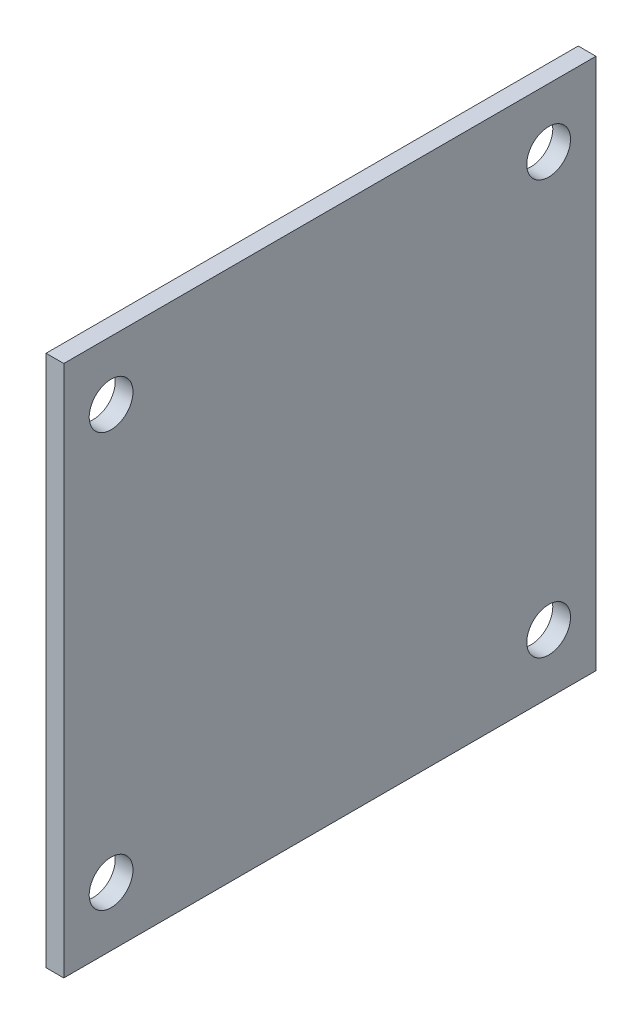
ISO-10303-21;
HEADER;
FILE_DESCRIPTION(('STEP AP214'),'2;1');
FILE_NAME('part.step','',(''),(''),'','','');
FILE_SCHEMA(('AUTOMOTIVE_DESIGN { 1 0 10303 214 1 1 1 1 }'));
ENDSEC;
DATA;
#1=APPLICATION_CONTEXT('core data for automotive mechanical design processes');
#2=APPLICATION_PROTOCOL_DEFINITION('international standard','automotive_design',2000,#1);
#3=PRODUCT_CONTEXT('',#1,'mechanical');
#4=PRODUCT('Part','Part','',(#3));
#5=PRODUCT_RELATED_PRODUCT_CATEGORY('part','',(#4));
#6=PRODUCT_DEFINITION_FORMATION('','',#4);
#7=PRODUCT_DEFINITION_CONTEXT('part definition',#1,'design');
#8=PRODUCT_DEFINITION('design','',#6,#7);
#9=PRODUCT_DEFINITION_SHAPE('','',#8);
#10=(LENGTH_UNIT() NAMED_UNIT(*) SI_UNIT(.MILLI.,.METRE.));
#11=(NAMED_UNIT(*) PLANE_ANGLE_UNIT() SI_UNIT($,.RADIAN.));
#12=(NAMED_UNIT(*) SI_UNIT($,.STERADIAN.) SOLID_ANGLE_UNIT());
#13=UNCERTAINTY_MEASURE_WITH_UNIT(LENGTH_MEASURE(1.E-05),#10,'distance_accuracy_value','');
#14=(GEOMETRIC_REPRESENTATION_CONTEXT(3) GLOBAL_UNCERTAINTY_ASSIGNED_CONTEXT((#13)) GLOBAL_UNIT_ASSIGNED_CONTEXT((#10,
#11,#12)) REPRESENTATION_CONTEXT('',''));
#15=CARTESIAN_POINT('',(0.,0.,0.));
#16=DIRECTION('',(0.,0.,1.));
#17=DIRECTION('',(1.,0.,0.));
#18=AXIS2_PLACEMENT_3D('',#15,#16,#17);
#19=CARTESIAN_POINT('',(1.5,-22.5,-22.5));
#20=DIRECTION('',(0.,0.,1.));
#21=DIRECTION('',(1.,0.,0.));
#22=AXIS2_PLACEMENT_3D('',#19,#20,#21);
#23=PLANE('',#22);
#24=DIRECTION('',(0.,1.,0.));
#25=VECTOR('',#24,1.);
#26=CARTESIAN_POINT('',(0.,-22.5,-22.5));
#27=LINE('',#26,#25);
#28=CARTESIAN_POINT('',(0.,-22.5,-22.5));
#29=VERTEX_POINT('',#28);
#30=CARTESIAN_POINT('',(0.,22.5,-22.5));
#31=VERTEX_POINT('',#30);
#32=EDGE_CURVE('E98',#29,#31,#27,.T.);
#33=ORIENTED_EDGE('',*,*,#32,.T.);
#34=DIRECTION('',(-1.,0.,0.));
#35=VECTOR('',#34,1.);
#36=CARTESIAN_POINT('',(1.5,22.5,-22.5));
#37=LINE('',#36,#35);
#38=CARTESIAN_POINT('',(1.5,22.5,-22.5));
#39=VERTEX_POINT('',#38);
#40=EDGE_CURVE('E11',#39,#31,#37,.T.);
#41=ORIENTED_EDGE('',*,*,#40,.F.);
#42=DIRECTION('',(0.,1.,0.));
#43=VECTOR('',#42,1.);
#44=CARTESIAN_POINT('',(1.5,-22.5,-22.5));
#45=LINE('',#44,#43);
#46=CARTESIAN_POINT('',(1.5,-22.5,-22.5));
#47=VERTEX_POINT('',#46);
#48=EDGE_CURVE('E86',#47,#39,#45,.T.);
#49=ORIENTED_EDGE('',*,*,#48,.F.);
#50=DIRECTION('',(-1.,0.,0.));
#51=VECTOR('',#50,1.);
#52=CARTESIAN_POINT('',(1.5,-22.5,-22.5));
#53=LINE('',#52,#51);
#54=EDGE_CURVE('E94',#47,#29,#53,.T.);
#55=ORIENTED_EDGE('',*,*,#54,.T.);
#56=EDGE_LOOP('',(#33,#41,#49,#55));
#57=FACE_BOUND('',#56,.T.);
#58=ADVANCED_FACE('F35',(#57),#23,.F.);
#59=CARTESIAN_POINT('',(1.5,22.5,22.5));
#60=DIRECTION('',(0.,-1.,0.));
#61=DIRECTION('',(0.,0.,-1.));
#62=AXIS2_PLACEMENT_3D('',#59,#60,#61);
#63=PLANE('',#62);
#64=DIRECTION('',(0.,0.,1.));
#65=VECTOR('',#64,1.);
#66=CARTESIAN_POINT('',(0.,22.5,22.5));
#67=LINE('',#66,#65);
#68=CARTESIAN_POINT('',(0.,22.5,22.5));
#69=VERTEX_POINT('',#68);
#70=EDGE_CURVE('E90',#31,#69,#67,.T.);
#71=ORIENTED_EDGE('',*,*,#70,.T.);
#72=DIRECTION('',(-1.,0.,0.));
#73=VECTOR('',#72,1.);
#74=CARTESIAN_POINT('',(1.5,22.5,22.5));
#75=LINE('',#74,#73);
#76=CARTESIAN_POINT('',(1.5,22.5,22.5));
#77=VERTEX_POINT('',#76);
#78=EDGE_CURVE('E43',#77,#69,#75,.T.);
#79=ORIENTED_EDGE('',*,*,#78,.F.);
#80=DIRECTION('',(0.,0.,1.));
#81=VECTOR('',#80,1.);
#82=CARTESIAN_POINT('',(1.5,22.5,22.5));
#83=LINE('',#82,#81);
#84=EDGE_CURVE('E81',#39,#77,#83,.T.);
#85=ORIENTED_EDGE('',*,*,#84,.F.);
#86=ORIENTED_EDGE('',*,*,#40,.T.);
#87=EDGE_LOOP('',(#71,#79,#85,#86));
#88=FACE_BOUND('',#87,.T.);
#89=ADVANCED_FACE('F89',(#88),#63,.F.);
#90=CARTESIAN_POINT('',(1.5,-22.5,22.5));
#91=DIRECTION('',(0.,0.,-1.));
#92=DIRECTION('',(-1.,0.,0.));
#93=AXIS2_PLACEMENT_3D('',#90,#91,#92);
#94=PLANE('',#93);
#95=DIRECTION('',(0.,-1.,0.));
#96=VECTOR('',#95,1.);
#97=CARTESIAN_POINT('',(0.,-22.5,22.5));
#98=LINE('',#97,#96);
#99=CARTESIAN_POINT('',(0.,-22.5,22.5));
#100=VERTEX_POINT('',#99);
#101=EDGE_CURVE('E68',#69,#100,#98,.T.);
#102=ORIENTED_EDGE('',*,*,#101,.T.);
#103=DIRECTION('',(-1.,0.,0.));
#104=VECTOR('',#103,1.);
#105=CARTESIAN_POINT('',(1.5,-22.5,22.5));
#106=LINE('',#105,#104);
#107=CARTESIAN_POINT('',(1.5,-22.5,22.5));
#108=VERTEX_POINT('',#107);
#109=EDGE_CURVE('E91',#108,#100,#106,.T.);
#110=ORIENTED_EDGE('',*,*,#109,.F.);
#111=DIRECTION('',(0.,-1.,0.));
#112=VECTOR('',#111,1.);
#113=CARTESIAN_POINT('',(1.5,-22.5,22.5));
#114=LINE('',#113,#112);
#115=EDGE_CURVE('E84',#77,#108,#114,.T.);
#116=ORIENTED_EDGE('',*,*,#115,.F.);
#117=ORIENTED_EDGE('',*,*,#78,.T.);
#118=EDGE_LOOP('',(#102,#110,#116,#117));
#119=FACE_BOUND('',#118,.T.);
#120=ADVANCED_FACE('F92',(#119),#94,.F.);
#121=CARTESIAN_POINT('',(1.5,-22.5,22.5));
#122=DIRECTION('',(0.,1.,0.));
#123=DIRECTION('',(0.,0.,1.));
#124=AXIS2_PLACEMENT_3D('',#121,#122,#123);
#125=PLANE('',#124);
#126=DIRECTION('',(0.,0.,-1.));
#127=VECTOR('',#126,1.);
#128=CARTESIAN_POINT('',(0.,-22.5,22.5));
#129=LINE('',#128,#127);
#130=EDGE_CURVE('E74',#100,#29,#129,.T.);
#131=ORIENTED_EDGE('',*,*,#130,.T.);
#132=ORIENTED_EDGE('',*,*,#54,.F.);
#133=DIRECTION('',(0.,0.,-1.));
#134=VECTOR('',#133,1.);
#135=CARTESIAN_POINT('',(1.5,-22.5,22.5));
#136=LINE('',#135,#134);
#137=EDGE_CURVE('E51',#108,#47,#136,.T.);
#138=ORIENTED_EDGE('',*,*,#137,.F.);
#139=ORIENTED_EDGE('',*,*,#109,.T.);
#140=EDGE_LOOP('',(#131,#132,#138,#139));
#141=FACE_BOUND('',#140,.T.);
#142=ADVANCED_FACE('F106',(#141),#125,.F.);
#143=CARTESIAN_POINT('',(1.5,22.5,-22.5));
#144=DIRECTION('',(-1.,0.,0.));
#145=DIRECTION('',(0.,0.,1.));
#146=AXIS2_PLACEMENT_3D('',#143,#144,#145);
#147=PLANE('',#146);
#148=CARTESIAN_POINT('',(1.5,-17.5,-18.5));
#149=DIRECTION('',(1.,0.,0.));
#150=DIRECTION('',(0.,0.,-1.));
#151=AXIS2_PLACEMENT_3D('',#148,#149,#150);
#152=CIRCLE('',#151,1.85);
#153=CARTESIAN_POINT('',(1.5,-17.5,-20.35));
#154=VERTEX_POINT('',#153);
#155=EDGE_CURVE('E130',#154,#154,#152,.T.);
#156=ORIENTED_EDGE('',*,*,#155,.F.);
#157=EDGE_LOOP('',(#156));
#158=FACE_BOUND('',#157,.T.);
#159=CARTESIAN_POINT('',(1.5,17.5,-18.5));
#160=DIRECTION('',(1.,0.,0.));
#161=DIRECTION('',(0.,0.,-1.));
#162=AXIS2_PLACEMENT_3D('',#159,#160,#161);
#163=CIRCLE('',#162,1.85);
#164=CARTESIAN_POINT('',(1.5,17.5,-20.35));
#165=VERTEX_POINT('',#164);
#166=EDGE_CURVE('E124',#165,#165,#163,.T.);
#167=ORIENTED_EDGE('',*,*,#166,.F.);
#168=EDGE_LOOP('',(#167));
#169=FACE_BOUND('',#168,.T.);
#170=CARTESIAN_POINT('',(1.5,-17.5,18.5));
#171=DIRECTION('',(1.,0.,0.));
#172=DIRECTION('',(0.,0.,-1.));
#173=AXIS2_PLACEMENT_3D('',#170,#171,#172);
#174=CIRCLE('',#173,1.85);
#175=CARTESIAN_POINT('',(1.5,-17.5,16.65));
#176=VERTEX_POINT('',#175);
#177=EDGE_CURVE('E118',#176,#176,#174,.T.);
#178=ORIENTED_EDGE('',*,*,#177,.F.);
#179=EDGE_LOOP('',(#178));
#180=FACE_BOUND('',#179,.T.);
#181=CARTESIAN_POINT('',(1.5,17.5,18.5));
#182=DIRECTION('',(1.,0.,0.));
#183=DIRECTION('',(0.,0.,-1.));
#184=AXIS2_PLACEMENT_3D('',#181,#182,#183);
#185=CIRCLE('',#184,1.85);
#186=CARTESIAN_POINT('',(1.5,17.5,16.65));
#187=VERTEX_POINT('',#186);
#188=EDGE_CURVE('E112',#187,#187,#185,.T.);
#189=ORIENTED_EDGE('',*,*,#188,.F.);
#190=EDGE_LOOP('',(#189));
#191=FACE_BOUND('',#190,.T.);
#192=ORIENTED_EDGE('',*,*,#48,.T.);
#193=ORIENTED_EDGE('',*,*,#84,.T.);
#194=ORIENTED_EDGE('',*,*,#115,.T.);
#195=ORIENTED_EDGE('',*,*,#137,.T.);
#196=EDGE_LOOP('',(#192,#193,#194,#195));
#197=FACE_BOUND('',#196,.T.);
#198=ADVANCED_FACE('F82',(#158,#169,#180,#191,#197),#147,.F.);
#199=CARTESIAN_POINT('',(0.,22.5,-22.5));
#200=DIRECTION('',(-1.,0.,0.));
#201=DIRECTION('',(0.,0.,1.));
#202=AXIS2_PLACEMENT_3D('',#199,#200,#201);
#203=PLANE('',#202);
#204=CARTESIAN_POINT('',(0.,-17.5,-18.5));
#205=DIRECTION('',(1.,0.,0.));
#206=DIRECTION('',(0.,0.,-1.));
#207=AXIS2_PLACEMENT_3D('',#204,#205,#206);
#208=CIRCLE('',#207,1.85);
#209=CARTESIAN_POINT('',(0.,-17.5,-20.35));
#210=VERTEX_POINT('',#209);
#211=EDGE_CURVE('E127',#210,#210,#208,.T.);
#212=ORIENTED_EDGE('',*,*,#211,.T.);
#213=EDGE_LOOP('',(#212));
#214=FACE_BOUND('',#213,.T.);
#215=CARTESIAN_POINT('',(0.,17.5,-18.5));
#216=DIRECTION('',(1.,0.,0.));
#217=DIRECTION('',(0.,0.,-1.));
#218=AXIS2_PLACEMENT_3D('',#215,#216,#217);
#219=CIRCLE('',#218,1.85);
#220=CARTESIAN_POINT('',(0.,17.5,-20.35));
#221=VERTEX_POINT('',#220);
#222=EDGE_CURVE('E121',#221,#221,#219,.T.);
#223=ORIENTED_EDGE('',*,*,#222,.T.);
#224=EDGE_LOOP('',(#223));
#225=FACE_BOUND('',#224,.T.);
#226=CARTESIAN_POINT('',(0.,-17.5,18.5));
#227=DIRECTION('',(1.,0.,0.));
#228=DIRECTION('',(0.,0.,-1.));
#229=AXIS2_PLACEMENT_3D('',#226,#227,#228);
#230=CIRCLE('',#229,1.85);
#231=CARTESIAN_POINT('',(0.,-17.5,16.65));
#232=VERTEX_POINT('',#231);
#233=EDGE_CURVE('E115',#232,#232,#230,.T.);
#234=ORIENTED_EDGE('',*,*,#233,.T.);
#235=EDGE_LOOP('',(#234));
#236=FACE_BOUND('',#235,.T.);
#237=CARTESIAN_POINT('',(0.,17.5,18.5));
#238=DIRECTION('',(1.,0.,0.));
#239=DIRECTION('',(0.,0.,-1.));
#240=AXIS2_PLACEMENT_3D('',#237,#238,#239);
#241=CIRCLE('',#240,1.85);
#242=CARTESIAN_POINT('',(0.,17.5,16.65));
#243=VERTEX_POINT('',#242);
#244=EDGE_CURVE('E101',#243,#243,#241,.T.);
#245=ORIENTED_EDGE('',*,*,#244,.T.);
#246=EDGE_LOOP('',(#245));
#247=FACE_BOUND('',#246,.T.);
#248=ORIENTED_EDGE('',*,*,#32,.F.);
#249=ORIENTED_EDGE('',*,*,#130,.F.);
#250=ORIENTED_EDGE('',*,*,#101,.F.);
#251=ORIENTED_EDGE('',*,*,#70,.F.);
#252=EDGE_LOOP('',(#248,#249,#250,#251));
#253=FACE_BOUND('',#252,.T.);
#254=ADVANCED_FACE('F109',(#214,#225,#236,#247,#253),#203,.T.);
#255=CARTESIAN_POINT('',(0.,17.5,18.5));
#256=DIRECTION('',(1.,0.,0.));
#257=DIRECTION('',(0.,0.,-1.));
#258=AXIS2_PLACEMENT_3D('',#255,#256,#257);
#259=CYLINDRICAL_SURFACE('',#258,1.85);
#260=ORIENTED_EDGE('',*,*,#244,.F.);
#261=EDGE_LOOP('',(#260));
#262=FACE_BOUND('',#261,.T.);
#263=ORIENTED_EDGE('',*,*,#188,.T.);
#264=EDGE_LOOP('',(#263));
#265=FACE_BOUND('',#264,.T.);
#266=ADVANCED_FACE('F154',(#262,#265),#259,.F.);
#267=CARTESIAN_POINT('',(0.,-17.5,18.5));
#268=DIRECTION('',(1.,0.,0.));
#269=DIRECTION('',(0.,0.,-1.));
#270=AXIS2_PLACEMENT_3D('',#267,#268,#269);
#271=CYLINDRICAL_SURFACE('',#270,1.85);
#272=ORIENTED_EDGE('',*,*,#233,.F.);
#273=EDGE_LOOP('',(#272));
#274=FACE_BOUND('',#273,.T.);
#275=ORIENTED_EDGE('',*,*,#177,.T.);
#276=EDGE_LOOP('',(#275));
#277=FACE_BOUND('',#276,.T.);
#278=ADVANCED_FACE('F156',(#274,#277),#271,.F.);
#279=CARTESIAN_POINT('',(0.,17.5,-18.5));
#280=DIRECTION('',(1.,0.,0.));
#281=DIRECTION('',(0.,0.,-1.));
#282=AXIS2_PLACEMENT_3D('',#279,#280,#281);
#283=CYLINDRICAL_SURFACE('',#282,1.85);
#284=ORIENTED_EDGE('',*,*,#222,.F.);
#285=EDGE_LOOP('',(#284));
#286=FACE_BOUND('',#285,.T.);
#287=ORIENTED_EDGE('',*,*,#166,.T.);
#288=EDGE_LOOP('',(#287));
#289=FACE_BOUND('',#288,.T.);
#290=ADVANCED_FACE('F141',(#286,#289),#283,.F.);
#291=CARTESIAN_POINT('',(0.,-17.5,-18.5));
#292=DIRECTION('',(1.,0.,0.));
#293=DIRECTION('',(0.,0.,-1.));
#294=AXIS2_PLACEMENT_3D('',#291,#292,#293);
#295=CYLINDRICAL_SURFACE('',#294,1.85);
#296=ORIENTED_EDGE('',*,*,#211,.F.);
#297=EDGE_LOOP('',(#296));
#298=FACE_BOUND('',#297,.T.);
#299=ORIENTED_EDGE('',*,*,#155,.T.);
#300=EDGE_LOOP('',(#299));
#301=FACE_BOUND('',#300,.T.);
#302=ADVANCED_FACE('F138',(#298,#301),#295,.F.);
#303=CLOSED_SHELL('',(#58,#89,#120,#142,#198,#254,#266,#278,#290,#302));
#304=MANIFOLD_SOLID_BREP('B2',#303);
#305=ADVANCED_BREP_SHAPE_REPRESENTATION('',(#18,#304),#14);
#306=SHAPE_DEFINITION_REPRESENTATION(#9,#305);
ENDSEC;
END-ISO-10303-21;
